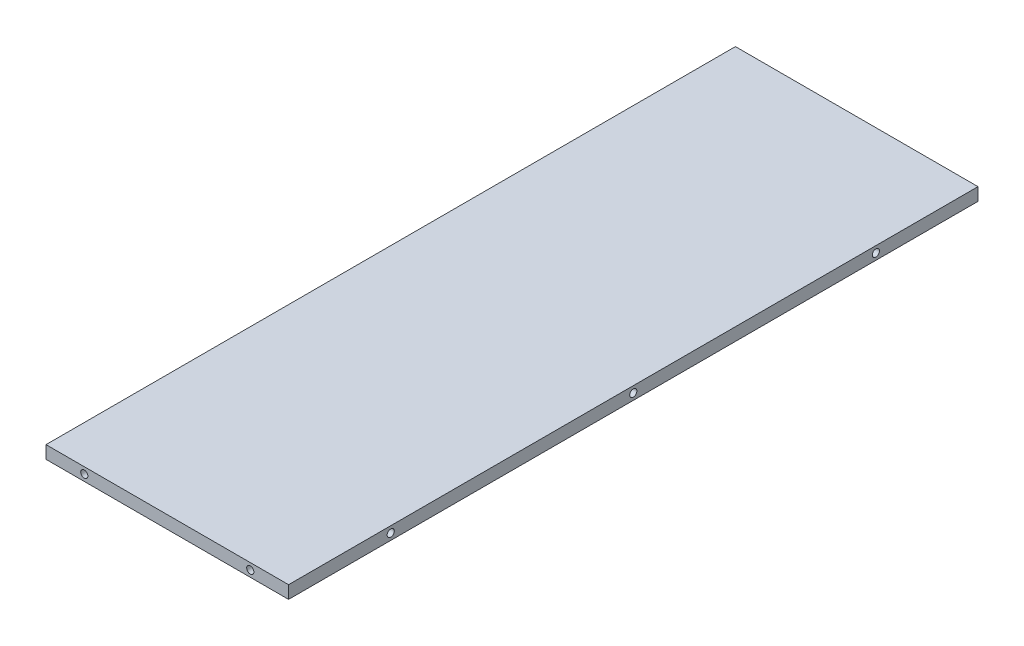
ISO-10303-21;
HEADER;
FILE_DESCRIPTION(('STEP AP214'),'2;1');
FILE_NAME('part.step','',(''),(''),'','','');
FILE_SCHEMA(('AUTOMOTIVE_DESIGN { 1 0 10303 214 1 1 1 1 }'));
ENDSEC;
DATA;
#1=APPLICATION_CONTEXT('core data for automotive mechanical design processes');
#2=APPLICATION_PROTOCOL_DEFINITION('international standard','automotive_design',2000,#1);
#3=PRODUCT_CONTEXT('',#1,'mechanical');
#4=PRODUCT('Part','Part','',(#3));
#5=PRODUCT_RELATED_PRODUCT_CATEGORY('part','',(#4));
#6=PRODUCT_DEFINITION_FORMATION('','',#4);
#7=PRODUCT_DEFINITION_CONTEXT('part definition',#1,'design');
#8=PRODUCT_DEFINITION('design','',#6,#7);
#9=PRODUCT_DEFINITION_SHAPE('','',#8);
#10=(LENGTH_UNIT() NAMED_UNIT(*) SI_UNIT(.MILLI.,.METRE.));
#11=(NAMED_UNIT(*) PLANE_ANGLE_UNIT() SI_UNIT($,.RADIAN.));
#12=(NAMED_UNIT(*) SI_UNIT($,.STERADIAN.) SOLID_ANGLE_UNIT());
#13=UNCERTAINTY_MEASURE_WITH_UNIT(LENGTH_MEASURE(1.E-05),#10,'distance_accuracy_value','');
#14=(GEOMETRIC_REPRESENTATION_CONTEXT(3) GLOBAL_UNCERTAINTY_ASSIGNED_CONTEXT((#13)) GLOBAL_UNIT_ASSIGNED_CONTEXT((#10,
#11,#12)) REPRESENTATION_CONTEXT('',''));
#15=CARTESIAN_POINT('',(0.,0.,0.));
#16=DIRECTION('',(0.,0.,1.));
#17=DIRECTION('',(1.,0.,0.));
#18=AXIS2_PLACEMENT_3D('',#15,#16,#17);
#19=CARTESIAN_POINT('',(-30.1625,3.175,-85.725));
#20=DIRECTION('',(1.,0.,0.));
#21=DIRECTION('',(0.,0.,-1.));
#22=AXIS2_PLACEMENT_3D('',#19,#20,#21);
#23=PLANE('',#22);
#24=CARTESIAN_POINT('',(-30.1625,1.5875,-60.325));
#25=DIRECTION('',(-1.,0.,0.));
#26=DIRECTION('',(0.,0.,1.));
#27=AXIS2_PLACEMENT_3D('',#24,#25,#26);
#28=CIRCLE('',#27,0.888999999999989);
#29=CARTESIAN_POINT('',(-30.1625,1.5875,-59.436));
#30=VERTEX_POINT('',#29);
#31=EDGE_CURVE('E111',#30,#30,#28,.T.);
#32=ORIENTED_EDGE('',*,*,#31,.F.);
#33=EDGE_LOOP('',(#32));
#34=FACE_BOUND('',#33,.T.);
#35=CARTESIAN_POINT('',(-30.1625,1.5875,60.325));
#36=DIRECTION('',(-1.,0.,0.));
#37=DIRECTION('',(0.,0.,1.));
#38=AXIS2_PLACEMENT_3D('',#35,#36,#37);
#39=CIRCLE('',#38,0.888999999999989);
#40=CARTESIAN_POINT('',(-30.1625,1.5875,61.214));
#41=VERTEX_POINT('',#40);
#42=EDGE_CURVE('E110',#41,#41,#39,.T.);
#43=ORIENTED_EDGE('',*,*,#42,.F.);
#44=EDGE_LOOP('',(#43));
#45=FACE_BOUND('',#44,.T.);
#46=CARTESIAN_POINT('',(-30.1625,1.5875,0.));
#47=DIRECTION('',(-1.,0.,0.));
#48=DIRECTION('',(0.,0.,1.));
#49=AXIS2_PLACEMENT_3D('',#46,#47,#48);
#50=CIRCLE('',#49,0.888999999999989);
#51=CARTESIAN_POINT('',(-30.1625,1.5875,0.889000000000003));
#52=VERTEX_POINT('',#51);
#53=EDGE_CURVE('E139',#52,#52,#50,.T.);
#54=ORIENTED_EDGE('',*,*,#53,.F.);
#55=EDGE_LOOP('',(#54));
#56=FACE_BOUND('',#55,.T.);
#57=DIRECTION('',(0.,0.,1.));
#58=VECTOR('',#57,1.);
#59=CARTESIAN_POINT('',(-30.1625,0.,-85.725));
#60=LINE('',#59,#58);
#61=CARTESIAN_POINT('',(-30.1625,0.,-85.725));
#62=VERTEX_POINT('',#61);
#63=CARTESIAN_POINT('',(-30.1625,0.,85.725));
#64=VERTEX_POINT('',#63);
#65=EDGE_CURVE('E169',#62,#64,#60,.T.);
#66=ORIENTED_EDGE('',*,*,#65,.T.);
#67=DIRECTION('',(0.,-1.,0.));
#68=VECTOR('',#67,1.);
#69=CARTESIAN_POINT('',(-30.1625,3.175,85.725));
#70=LINE('',#69,#68);
#71=CARTESIAN_POINT('',(-30.1625,3.175,85.725));
#72=VERTEX_POINT('',#71);
#73=EDGE_CURVE('E11',#72,#64,#70,.T.);
#74=ORIENTED_EDGE('',*,*,#73,.F.);
#75=DIRECTION('',(0.,0.,1.));
#76=VECTOR('',#75,1.);
#77=CARTESIAN_POINT('',(-30.1625,3.175,-85.725));
#78=LINE('',#77,#76);
#79=CARTESIAN_POINT('',(-30.1625,3.175,-85.725));
#80=VERTEX_POINT('',#79);
#81=EDGE_CURVE('E178',#80,#72,#78,.T.);
#82=ORIENTED_EDGE('',*,*,#81,.F.);
#83=DIRECTION('',(0.,-1.,0.));
#84=VECTOR('',#83,1.);
#85=CARTESIAN_POINT('',(-30.1625,3.175,-85.725));
#86=LINE('',#85,#84);
#87=EDGE_CURVE('E184',#80,#62,#86,.T.);
#88=ORIENTED_EDGE('',*,*,#87,.T.);
#89=EDGE_LOOP('',(#66,#74,#82,#88));
#90=FACE_BOUND('',#89,.T.);
#91=ADVANCED_FACE('F32',(#34,#45,#56,#90),#23,.F.);
#92=CARTESIAN_POINT('',(-30.1625,3.175,85.725));
#93=DIRECTION('',(0.,0.,-1.));
#94=DIRECTION('',(-1.,0.,0.));
#95=AXIS2_PLACEMENT_3D('',#92,#93,#94);
#96=PLANE('',#95);
#97=CARTESIAN_POINT('',(-20.6375,1.5875,85.725));
#98=DIRECTION('',(0.,0.,1.));
#99=DIRECTION('',(1.,0.,0.));
#100=AXIS2_PLACEMENT_3D('',#97,#98,#99);
#101=CIRCLE('',#100,0.888999999999987);
#102=CARTESIAN_POINT('',(-19.7485,1.5875,85.725));
#103=VERTEX_POINT('',#102);
#104=EDGE_CURVE('E160',#103,#103,#101,.T.);
#105=ORIENTED_EDGE('',*,*,#104,.F.);
#106=EDGE_LOOP('',(#105));
#107=FACE_BOUND('',#106,.T.);
#108=CARTESIAN_POINT('',(20.6375,1.5875,85.725));
#109=DIRECTION('',(0.,0.,1.));
#110=DIRECTION('',(1.,0.,0.));
#111=AXIS2_PLACEMENT_3D('',#108,#109,#110);
#112=CIRCLE('',#111,0.888999999999987);
#113=CARTESIAN_POINT('',(21.5265,1.5875,85.725));
#114=VERTEX_POINT('',#113);
#115=EDGE_CURVE('E166',#114,#114,#112,.T.);
#116=ORIENTED_EDGE('',*,*,#115,.F.);
#117=EDGE_LOOP('',(#116));
#118=FACE_BOUND('',#117,.T.);
#119=DIRECTION('',(1.,0.,0.));
#120=VECTOR('',#119,1.);
#121=CARTESIAN_POINT('',(-30.1625,0.,85.725));
#122=LINE('',#121,#120);
#123=CARTESIAN_POINT('',(30.1625,0.,85.725));
#124=VERTEX_POINT('',#123);
#125=EDGE_CURVE('E172',#64,#124,#122,.T.);
#126=ORIENTED_EDGE('',*,*,#125,.T.);
#127=DIRECTION('',(0.,-1.,0.));
#128=VECTOR('',#127,1.);
#129=CARTESIAN_POINT('',(30.1625,3.175,85.725));
#130=LINE('',#129,#128);
#131=CARTESIAN_POINT('',(30.1625,3.175,85.725));
#132=VERTEX_POINT('',#131);
#133=EDGE_CURVE('E39',#132,#124,#130,.T.);
#134=ORIENTED_EDGE('',*,*,#133,.F.);
#135=DIRECTION('',(1.,0.,0.));
#136=VECTOR('',#135,1.);
#137=CARTESIAN_POINT('',(-30.1625,3.175,85.725));
#138=LINE('',#137,#136);
#139=EDGE_CURVE('E180',#72,#132,#138,.T.);
#140=ORIENTED_EDGE('',*,*,#139,.F.);
#141=ORIENTED_EDGE('',*,*,#73,.T.);
#142=EDGE_LOOP('',(#126,#134,#140,#141));
#143=FACE_BOUND('',#142,.T.);
#144=ADVANCED_FACE('F205',(#107,#118,#143),#96,.F.);
#145=CARTESIAN_POINT('',(30.1625,3.175,-85.725));
#146=DIRECTION('',(-1.,0.,0.));
#147=DIRECTION('',(0.,0.,1.));
#148=AXIS2_PLACEMENT_3D('',#145,#146,#147);
#149=PLANE('',#148);
#150=CARTESIAN_POINT('',(30.1625,1.5875,-60.325));
#151=DIRECTION('',(1.,0.,0.));
#152=DIRECTION('',(0.,0.,-1.));
#153=AXIS2_PLACEMENT_3D('',#150,#151,#152);
#154=CIRCLE('',#153,0.888999999999989);
#155=CARTESIAN_POINT('',(30.1625,1.5875,-61.214));
#156=VERTEX_POINT('',#155);
#157=EDGE_CURVE('E121',#156,#156,#154,.T.);
#158=ORIENTED_EDGE('',*,*,#157,.F.);
#159=EDGE_LOOP('',(#158));
#160=FACE_BOUND('',#159,.T.);
#161=CARTESIAN_POINT('',(30.1625,1.5875,60.325));
#162=DIRECTION('',(1.,0.,0.));
#163=DIRECTION('',(0.,0.,-1.));
#164=AXIS2_PLACEMENT_3D('',#161,#162,#163);
#165=CIRCLE('',#164,0.888999999999989);
#166=CARTESIAN_POINT('',(30.1625,1.5875,59.436));
#167=VERTEX_POINT('',#166);
#168=EDGE_CURVE('E127',#167,#167,#165,.T.);
#169=ORIENTED_EDGE('',*,*,#168,.F.);
#170=EDGE_LOOP('',(#169));
#171=FACE_BOUND('',#170,.T.);
#172=CARTESIAN_POINT('',(30.1625,1.5875,0.));
#173=DIRECTION('',(1.,0.,0.));
#174=DIRECTION('',(0.,0.,-1.));
#175=AXIS2_PLACEMENT_3D('',#172,#173,#174);
#176=CIRCLE('',#175,0.888999999999989);
#177=CARTESIAN_POINT('',(30.1625,1.5875,-0.888999999999975));
#178=VERTEX_POINT('',#177);
#179=EDGE_CURVE('E133',#178,#178,#176,.T.);
#180=ORIENTED_EDGE('',*,*,#179,.F.);
#181=EDGE_LOOP('',(#180));
#182=FACE_BOUND('',#181,.T.);
#183=DIRECTION('',(0.,0.,-1.));
#184=VECTOR('',#183,1.);
#185=CARTESIAN_POINT('',(30.1625,0.,-85.725));
#186=LINE('',#185,#184);
#187=CARTESIAN_POINT('',(30.1625,0.,-85.725));
#188=VERTEX_POINT('',#187);
#189=EDGE_CURVE('E174',#124,#188,#186,.T.);
#190=ORIENTED_EDGE('',*,*,#189,.T.);
#191=DIRECTION('',(0.,-1.,0.));
#192=VECTOR('',#191,1.);
#193=CARTESIAN_POINT('',(30.1625,3.175,-85.725));
#194=LINE('',#193,#192);
#195=CARTESIAN_POINT('',(30.1625,3.175,-85.725));
#196=VERTEX_POINT('',#195);
#197=EDGE_CURVE('E187',#196,#188,#194,.T.);
#198=ORIENTED_EDGE('',*,*,#197,.F.);
#199=DIRECTION('',(0.,0.,-1.));
#200=VECTOR('',#199,1.);
#201=CARTESIAN_POINT('',(30.1625,3.175,-85.725));
#202=LINE('',#201,#200);
#203=EDGE_CURVE('E51',#132,#196,#202,.T.);
#204=ORIENTED_EDGE('',*,*,#203,.F.);
#205=ORIENTED_EDGE('',*,*,#133,.T.);
#206=EDGE_LOOP('',(#190,#198,#204,#205));
#207=FACE_BOUND('',#206,.T.);
#208=ADVANCED_FACE('F193',(#160,#171,#182,#207),#149,.F.);
#209=CARTESIAN_POINT('',(-30.1625,3.175,-85.725));
#210=DIRECTION('',(0.,0.,1.));
#211=DIRECTION('',(1.,0.,0.));
#212=AXIS2_PLACEMENT_3D('',#209,#210,#211);
#213=PLANE('',#212);
#214=CARTESIAN_POINT('',(20.6375,1.5875,-85.725));
#215=DIRECTION('',(0.,0.,-1.));
#216=DIRECTION('',(-1.,0.,0.));
#217=AXIS2_PLACEMENT_3D('',#214,#215,#216);
#218=CIRCLE('',#217,0.888999999999987);
#219=CARTESIAN_POINT('',(19.7485,1.5875,-85.725));
#220=VERTEX_POINT('',#219);
#221=EDGE_CURVE('E145',#220,#220,#218,.T.);
#222=ORIENTED_EDGE('',*,*,#221,.F.);
#223=EDGE_LOOP('',(#222));
#224=FACE_BOUND('',#223,.T.);
#225=CARTESIAN_POINT('',(-20.6375,1.5875,-85.725));
#226=DIRECTION('',(0.,0.,-1.));
#227=DIRECTION('',(-1.,0.,0.));
#228=AXIS2_PLACEMENT_3D('',#225,#226,#227);
#229=CIRCLE('',#228,0.888999999999987);
#230=CARTESIAN_POINT('',(-21.5265,1.5875,-85.725));
#231=VERTEX_POINT('',#230);
#232=EDGE_CURVE('E151',#231,#231,#229,.T.);
#233=ORIENTED_EDGE('',*,*,#232,.F.);
#234=EDGE_LOOP('',(#233));
#235=FACE_BOUND('',#234,.T.);
#236=DIRECTION('',(-1.,0.,0.));
#237=VECTOR('',#236,1.);
#238=CARTESIAN_POINT('',(-30.1625,0.,-85.725));
#239=LINE('',#238,#237);
#240=EDGE_CURVE('E176',#188,#62,#239,.T.);
#241=ORIENTED_EDGE('',*,*,#240,.T.);
#242=ORIENTED_EDGE('',*,*,#87,.F.);
#243=DIRECTION('',(-1.,0.,0.));
#244=VECTOR('',#243,1.);
#245=CARTESIAN_POINT('',(-30.1625,3.175,-85.725));
#246=LINE('',#245,#244);
#247=EDGE_CURVE('E46',#196,#80,#246,.T.);
#248=ORIENTED_EDGE('',*,*,#247,.F.);
#249=ORIENTED_EDGE('',*,*,#197,.T.);
#250=EDGE_LOOP('',(#241,#242,#248,#249));
#251=FACE_BOUND('',#250,.T.);
#252=ADVANCED_FACE('F200',(#224,#235,#251),#213,.F.);
#253=CARTESIAN_POINT('',(-30.1625,3.175,-85.725));
#254=DIRECTION('',(0.,1.,0.));
#255=DIRECTION('',(0.,0.,1.));
#256=AXIS2_PLACEMENT_3D('',#253,#254,#255);
#257=PLANE('',#256);
#258=ORIENTED_EDGE('',*,*,#81,.T.);
#259=ORIENTED_EDGE('',*,*,#139,.T.);
#260=ORIENTED_EDGE('',*,*,#203,.T.);
#261=ORIENTED_EDGE('',*,*,#247,.T.);
#262=EDGE_LOOP('',(#258,#259,#260,#261));
#263=FACE_BOUND('',#262,.T.);
#264=ADVANCED_FACE('F204',(#263),#257,.T.);
#265=CARTESIAN_POINT('',(-30.1625,0.,-85.725));
#266=DIRECTION('',(0.,1.,0.));
#267=DIRECTION('',(0.,0.,1.));
#268=AXIS2_PLACEMENT_3D('',#265,#266,#267);
#269=PLANE('',#268);
#270=ORIENTED_EDGE('',*,*,#65,.F.);
#271=ORIENTED_EDGE('',*,*,#240,.F.);
#272=ORIENTED_EDGE('',*,*,#189,.F.);
#273=ORIENTED_EDGE('',*,*,#125,.F.);
#274=EDGE_LOOP('',(#270,#271,#272,#273));
#275=FACE_BOUND('',#274,.T.);
#276=ADVANCED_FACE('F198',(#275),#269,.F.);
#277=CARTESIAN_POINT('',(20.6375,1.5875,85.725));
#278=DIRECTION('',(0.,0.,1.));
#279=DIRECTION('',(1.,0.,0.));
#280=AXIS2_PLACEMENT_3D('',#277,#278,#279);
#281=CYLINDRICAL_SURFACE('',#280,0.888999999999992);
#282=CARTESIAN_POINT('',(20.6375,1.5875,79.375));
#283=DIRECTION('',(0.,0.,1.));
#284=DIRECTION('',(1.,0.,0.));
#285=AXIS2_PLACEMENT_3D('',#282,#283,#284);
#286=CIRCLE('',#285,0.888999999999997);
#287=CARTESIAN_POINT('',(21.5265,1.5875,79.375));
#288=VERTEX_POINT('',#287);
#289=EDGE_CURVE('E163',#288,#288,#286,.T.);
#290=ORIENTED_EDGE('',*,*,#289,.F.);
#291=EDGE_LOOP('',(#290));
#292=FACE_BOUND('',#291,.T.);
#293=ORIENTED_EDGE('',*,*,#115,.T.);
#294=EDGE_LOOP('',(#293));
#295=FACE_BOUND('',#294,.T.);
#296=ADVANCED_FACE('F225',(#292,#295),#281,.F.);
#297=CARTESIAN_POINT('',(20.6375,1.5875,79.375));
#298=DIRECTION('',(0.,0.,1.));
#299=DIRECTION('',(1.,0.,0.));
#300=AXIS2_PLACEMENT_3D('',#297,#298,#299);
#301=CONICAL_SURFACE('',#300,0.888999999999997,1.02974425867666);
#302=CARTESIAN_POINT('',(20.6375,1.5875,78.8408349096845));
#303=VERTEX_POINT('',#302);
#304=VERTEX_LOOP('',#303);
#305=FACE_BOUND('',#304,.T.);
#306=ORIENTED_EDGE('',*,*,#289,.T.);
#307=EDGE_LOOP('',(#306));
#308=FACE_BOUND('',#307,.T.);
#309=ADVANCED_FACE('F228',(#305,#308),#301,.F.);
#310=CARTESIAN_POINT('',(-20.6375,1.5875,85.725));
#311=DIRECTION('',(0.,0.,1.));
#312=DIRECTION('',(1.,0.,0.));
#313=AXIS2_PLACEMENT_3D('',#310,#311,#312);
#314=CYLINDRICAL_SURFACE('',#313,0.888999999999992);
#315=CARTESIAN_POINT('',(-20.6375,1.5875,79.375));
#316=DIRECTION('',(0.,0.,1.));
#317=DIRECTION('',(1.,0.,0.));
#318=AXIS2_PLACEMENT_3D('',#315,#316,#317);
#319=CIRCLE('',#318,0.888999999999997);
#320=CARTESIAN_POINT('',(-19.7485,1.5875,79.375));
#321=VERTEX_POINT('',#320);
#322=EDGE_CURVE('E157',#321,#321,#319,.T.);
#323=ORIENTED_EDGE('',*,*,#322,.F.);
#324=EDGE_LOOP('',(#323));
#325=FACE_BOUND('',#324,.T.);
#326=ORIENTED_EDGE('',*,*,#104,.T.);
#327=EDGE_LOOP('',(#326));
#328=FACE_BOUND('',#327,.T.);
#329=ADVANCED_FACE('F232',(#325,#328),#314,.F.);
#330=CARTESIAN_POINT('',(-20.6375,1.5875,79.375));
#331=DIRECTION('',(0.,0.,1.));
#332=DIRECTION('',(1.,0.,0.));
#333=AXIS2_PLACEMENT_3D('',#330,#331,#332);
#334=CONICAL_SURFACE('',#333,0.888999999999997,1.02974425867665);
#335=CARTESIAN_POINT('',(-20.6375,1.5875,78.8408349096845));
#336=VERTEX_POINT('',#335);
#337=VERTEX_LOOP('',#336);
#338=FACE_BOUND('',#337,.T.);
#339=ORIENTED_EDGE('',*,*,#322,.T.);
#340=EDGE_LOOP('',(#339));
#341=FACE_BOUND('',#340,.T.);
#342=ADVANCED_FACE('F236',(#338,#341),#334,.F.);
#343=CARTESIAN_POINT('',(-20.6375,1.5875,-79.375));
#344=DIRECTION('',(0.,0.,-1.));
#345=DIRECTION('',(-1.,0.,0.));
#346=AXIS2_PLACEMENT_3D('',#343,#344,#345);
#347=CONICAL_SURFACE('',#346,0.888999999999987,1.02974425867665);
#348=CARTESIAN_POINT('',(-20.6375,1.5875,-78.8408349096845));
#349=VERTEX_POINT('',#348);
#350=VERTEX_LOOP('',#349);
#351=FACE_BOUND('',#350,.T.);
#352=CARTESIAN_POINT('',(-20.6375,1.5875,-79.375));
#353=DIRECTION('',(0.,0.,-1.));
#354=DIRECTION('',(-1.,0.,0.));
#355=AXIS2_PLACEMENT_3D('',#352,#353,#354);
#356=CIRCLE('',#355,0.888999999999987);
#357=CARTESIAN_POINT('',(-21.5265,1.5875,-79.375));
#358=VERTEX_POINT('',#357);
#359=EDGE_CURVE('E154',#358,#358,#356,.T.);
#360=ORIENTED_EDGE('',*,*,#359,.T.);
#361=EDGE_LOOP('',(#360));
#362=FACE_BOUND('',#361,.T.);
#363=ADVANCED_FACE('F240',(#351,#362),#347,.F.);
#364=CARTESIAN_POINT('',(-20.6375,1.5875,-85.725));
#365=DIRECTION('',(0.,0.,-1.));
#366=DIRECTION('',(-1.,0.,0.));
#367=AXIS2_PLACEMENT_3D('',#364,#365,#366);
#368=CYLINDRICAL_SURFACE('',#367,0.888999999999987);
#369=ORIENTED_EDGE('',*,*,#359,.F.);
#370=EDGE_LOOP('',(#369));
#371=FACE_BOUND('',#370,.T.);
#372=ORIENTED_EDGE('',*,*,#232,.T.);
#373=EDGE_LOOP('',(#372));
#374=FACE_BOUND('',#373,.T.);
#375=ADVANCED_FACE('F244',(#371,#374),#368,.F.);
#376=CARTESIAN_POINT('',(20.6375,1.5875,-79.375));
#377=DIRECTION('',(0.,0.,-1.));
#378=DIRECTION('',(-1.,0.,0.));
#379=AXIS2_PLACEMENT_3D('',#376,#377,#378);
#380=CONICAL_SURFACE('',#379,0.888999999999987,1.02974425867665);
#381=CARTESIAN_POINT('',(20.6375,1.5875,-78.8408349096845));
#382=VERTEX_POINT('',#381);
#383=VERTEX_LOOP('',#382);
#384=FACE_BOUND('',#383,.T.);
#385=CARTESIAN_POINT('',(20.6375,1.5875,-79.375));
#386=DIRECTION('',(0.,0.,-1.));
#387=DIRECTION('',(-1.,0.,0.));
#388=AXIS2_PLACEMENT_3D('',#385,#386,#387);
#389=CIRCLE('',#388,0.888999999999987);
#390=CARTESIAN_POINT('',(19.7485,1.5875,-79.375));
#391=VERTEX_POINT('',#390);
#392=EDGE_CURVE('E148',#391,#391,#389,.T.);
#393=ORIENTED_EDGE('',*,*,#392,.T.);
#394=EDGE_LOOP('',(#393));
#395=FACE_BOUND('',#394,.T.);
#396=ADVANCED_FACE('F248',(#384,#395),#380,.F.);
#397=CARTESIAN_POINT('',(20.6375,1.5875,-85.725));
#398=DIRECTION('',(0.,0.,-1.));
#399=DIRECTION('',(-1.,0.,0.));
#400=AXIS2_PLACEMENT_3D('',#397,#398,#399);
#401=CYLINDRICAL_SURFACE('',#400,0.888999999999987);
#402=ORIENTED_EDGE('',*,*,#392,.F.);
#403=EDGE_LOOP('',(#402));
#404=FACE_BOUND('',#403,.T.);
#405=ORIENTED_EDGE('',*,*,#221,.T.);
#406=EDGE_LOOP('',(#405));
#407=FACE_BOUND('',#406,.T.);
#408=ADVANCED_FACE('F252',(#404,#407),#401,.F.);
#409=CARTESIAN_POINT('',(-23.8125,1.5875,0.));
#410=DIRECTION('',(-1.,0.,0.));
#411=DIRECTION('',(0.,0.,1.));
#412=AXIS2_PLACEMENT_3D('',#409,#410,#411);
#413=CONICAL_SURFACE('',#412,0.888999999999987,1.02974425867665);
#414=CARTESIAN_POINT('',(-23.2783349096845,1.5875,0.));
#415=VERTEX_POINT('',#414);
#416=VERTEX_LOOP('',#415);
#417=FACE_BOUND('',#416,.T.);
#418=CARTESIAN_POINT('',(-23.8125,1.5875,0.));
#419=DIRECTION('',(-1.,0.,0.));
#420=DIRECTION('',(0.,0.,1.));
#421=AXIS2_PLACEMENT_3D('',#418,#419,#420);
#422=CIRCLE('',#421,0.888999999999987);
#423=CARTESIAN_POINT('',(-23.8125,1.5875,0.889));
#424=VERTEX_POINT('',#423);
#425=EDGE_CURVE('E142',#424,#424,#422,.T.);
#426=ORIENTED_EDGE('',*,*,#425,.T.);
#427=EDGE_LOOP('',(#426));
#428=FACE_BOUND('',#427,.T.);
#429=ADVANCED_FACE('F256',(#417,#428),#413,.F.);
#430=CARTESIAN_POINT('',(-30.1625,1.5875,0.));
#431=DIRECTION('',(-1.,0.,0.));
#432=DIRECTION('',(0.,0.,1.));
#433=AXIS2_PLACEMENT_3D('',#430,#431,#432);
#434=CYLINDRICAL_SURFACE('',#433,0.888999999999988);
#435=ORIENTED_EDGE('',*,*,#425,.F.);
#436=EDGE_LOOP('',(#435));
#437=FACE_BOUND('',#436,.T.);
#438=ORIENTED_EDGE('',*,*,#53,.T.);
#439=EDGE_LOOP('',(#438));
#440=FACE_BOUND('',#439,.T.);
#441=ADVANCED_FACE('F260',(#437,#440),#434,.F.);
#442=CARTESIAN_POINT('',(23.8125,1.5875,0.));
#443=DIRECTION('',(1.,0.,0.));
#444=DIRECTION('',(0.,0.,-1.));
#445=AXIS2_PLACEMENT_3D('',#442,#443,#444);
#446=CONICAL_SURFACE('',#445,0.888999999999987,1.02974425867665);
#447=CARTESIAN_POINT('',(23.2783349096845,1.5875,0.));
#448=VERTEX_POINT('',#447);
#449=VERTEX_LOOP('',#448);
#450=FACE_BOUND('',#449,.T.);
#451=CARTESIAN_POINT('',(23.8125,1.5875,0.));
#452=DIRECTION('',(1.,0.,0.));
#453=DIRECTION('',(0.,0.,-1.));
#454=AXIS2_PLACEMENT_3D('',#451,#452,#453);
#455=CIRCLE('',#454,0.888999999999987);
#456=CARTESIAN_POINT('',(23.8125,1.5875,-0.888999999999972));
#457=VERTEX_POINT('',#456);
#458=EDGE_CURVE('E136',#457,#457,#455,.T.);
#459=ORIENTED_EDGE('',*,*,#458,.T.);
#460=EDGE_LOOP('',(#459));
#461=FACE_BOUND('',#460,.T.);
#462=ADVANCED_FACE('F264',(#450,#461),#446,.F.);
#463=CARTESIAN_POINT('',(30.1625,1.5875,0.));
#464=DIRECTION('',(1.,0.,0.));
#465=DIRECTION('',(0.,0.,-1.));
#466=AXIS2_PLACEMENT_3D('',#463,#464,#465);
#467=CYLINDRICAL_SURFACE('',#466,0.888999999999988);
#468=ORIENTED_EDGE('',*,*,#458,.F.);
#469=EDGE_LOOP('',(#468));
#470=FACE_BOUND('',#469,.T.);
#471=ORIENTED_EDGE('',*,*,#179,.T.);
#472=EDGE_LOOP('',(#471));
#473=FACE_BOUND('',#472,.T.);
#474=ADVANCED_FACE('F268',(#470,#473),#467,.F.);
#475=CARTESIAN_POINT('',(23.8125,1.5875,60.325));
#476=DIRECTION('',(1.,0.,0.));
#477=DIRECTION('',(0.,0.,-1.));
#478=AXIS2_PLACEMENT_3D('',#475,#476,#477);
#479=CONICAL_SURFACE('',#478,0.888999999999987,1.02974425867665);
#480=CARTESIAN_POINT('',(23.2783349096845,1.5875,60.325));
#481=VERTEX_POINT('',#480);
#482=VERTEX_LOOP('',#481);
#483=FACE_BOUND('',#482,.T.);
#484=CARTESIAN_POINT('',(23.8125,1.5875,60.325));
#485=DIRECTION('',(1.,0.,0.));
#486=DIRECTION('',(0.,0.,-1.));
#487=AXIS2_PLACEMENT_3D('',#484,#485,#486);
#488=CIRCLE('',#487,0.888999999999987);
#489=CARTESIAN_POINT('',(23.8125,1.5875,59.436));
#490=VERTEX_POINT('',#489);
#491=EDGE_CURVE('E130',#490,#490,#488,.T.);
#492=ORIENTED_EDGE('',*,*,#491,.T.);
#493=EDGE_LOOP('',(#492));
#494=FACE_BOUND('',#493,.T.);
#495=ADVANCED_FACE('F272',(#483,#494),#479,.F.);
#496=CARTESIAN_POINT('',(30.1625,1.5875,60.325));
#497=DIRECTION('',(1.,0.,0.));
#498=DIRECTION('',(0.,0.,-1.));
#499=AXIS2_PLACEMENT_3D('',#496,#497,#498);
#500=CYLINDRICAL_SURFACE('',#499,0.888999999999988);
#501=ORIENTED_EDGE('',*,*,#491,.F.);
#502=EDGE_LOOP('',(#501));
#503=FACE_BOUND('',#502,.T.);
#504=ORIENTED_EDGE('',*,*,#168,.T.);
#505=EDGE_LOOP('',(#504));
#506=FACE_BOUND('',#505,.T.);
#507=ADVANCED_FACE('F276',(#503,#506),#500,.F.);
#508=CARTESIAN_POINT('',(23.8125,1.5875,-60.325));
#509=DIRECTION('',(1.,0.,0.));
#510=DIRECTION('',(0.,0.,-1.));
#511=AXIS2_PLACEMENT_3D('',#508,#509,#510);
#512=CONICAL_SURFACE('',#511,0.888999999999987,1.02974425867665);
#513=CARTESIAN_POINT('',(23.2783349096845,1.5875,-60.325));
#514=VERTEX_POINT('',#513);
#515=VERTEX_LOOP('',#514);
#516=FACE_BOUND('',#515,.T.);
#517=CARTESIAN_POINT('',(23.8125,1.5875,-60.325));
#518=DIRECTION('',(1.,0.,0.));
#519=DIRECTION('',(0.,0.,-1.));
#520=AXIS2_PLACEMENT_3D('',#517,#518,#519);
#521=CIRCLE('',#520,0.888999999999987);
#522=CARTESIAN_POINT('',(23.8125,1.5875,-61.214));
#523=VERTEX_POINT('',#522);
#524=EDGE_CURVE('E124',#523,#523,#521,.T.);
#525=ORIENTED_EDGE('',*,*,#524,.T.);
#526=EDGE_LOOP('',(#525));
#527=FACE_BOUND('',#526,.T.);
#528=ADVANCED_FACE('F280',(#516,#527),#512,.F.);
#529=CARTESIAN_POINT('',(30.1625,1.5875,-60.325));
#530=DIRECTION('',(1.,0.,0.));
#531=DIRECTION('',(0.,0.,-1.));
#532=AXIS2_PLACEMENT_3D('',#529,#530,#531);
#533=CYLINDRICAL_SURFACE('',#532,0.888999999999988);
#534=ORIENTED_EDGE('',*,*,#524,.F.);
#535=EDGE_LOOP('',(#534));
#536=FACE_BOUND('',#535,.T.);
#537=ORIENTED_EDGE('',*,*,#157,.T.);
#538=EDGE_LOOP('',(#537));
#539=FACE_BOUND('',#538,.T.);
#540=ADVANCED_FACE('F284',(#536,#539),#533,.F.);
#541=CARTESIAN_POINT('',(-23.8125,1.5875,60.325));
#542=DIRECTION('',(-1.,0.,0.));
#543=DIRECTION('',(0.,0.,1.));
#544=AXIS2_PLACEMENT_3D('',#541,#542,#543);
#545=CONICAL_SURFACE('',#544,0.888999999999987,1.02974425867665);
#546=CARTESIAN_POINT('',(-23.2783349096845,1.5875,60.325));
#547=VERTEX_POINT('',#546);
#548=VERTEX_LOOP('',#547);
#549=FACE_BOUND('',#548,.T.);
#550=CARTESIAN_POINT('',(-23.8125,1.5875,60.325));
#551=DIRECTION('',(-1.,0.,0.));
#552=DIRECTION('',(0.,0.,1.));
#553=AXIS2_PLACEMENT_3D('',#550,#551,#552);
#554=CIRCLE('',#553,0.888999999999987);
#555=CARTESIAN_POINT('',(-23.8125,1.5875,61.214));
#556=VERTEX_POINT('',#555);
#557=EDGE_CURVE('E114',#556,#556,#554,.T.);
#558=ORIENTED_EDGE('',*,*,#557,.T.);
#559=EDGE_LOOP('',(#558));
#560=FACE_BOUND('',#559,.T.);
#561=ADVANCED_FACE('F288',(#549,#560),#545,.F.);
#562=CARTESIAN_POINT('',(-30.1625,1.5875,60.325));
#563=DIRECTION('',(-1.,0.,0.));
#564=DIRECTION('',(0.,0.,1.));
#565=AXIS2_PLACEMENT_3D('',#562,#563,#564);
#566=CYLINDRICAL_SURFACE('',#565,0.888999999999988);
#567=ORIENTED_EDGE('',*,*,#557,.F.);
#568=EDGE_LOOP('',(#567));
#569=FACE_BOUND('',#568,.T.);
#570=ORIENTED_EDGE('',*,*,#42,.T.);
#571=EDGE_LOOP('',(#570));
#572=FACE_BOUND('',#571,.T.);
#573=ADVANCED_FACE('F104',(#569,#572),#566,.F.);
#574=CARTESIAN_POINT('',(-23.8125,1.5875,-60.325));
#575=DIRECTION('',(-1.,0.,0.));
#576=DIRECTION('',(0.,0.,1.));
#577=AXIS2_PLACEMENT_3D('',#574,#575,#576);
#578=CONICAL_SURFACE('',#577,0.888999999999987,1.02974425867665);
#579=CARTESIAN_POINT('',(-23.2783349096845,1.5875,-60.325));
#580=VERTEX_POINT('',#579);
#581=VERTEX_LOOP('',#580);
#582=FACE_BOUND('',#581,.T.);
#583=CARTESIAN_POINT('',(-23.8125,1.5875,-60.325));
#584=DIRECTION('',(-1.,0.,0.));
#585=DIRECTION('',(0.,0.,1.));
#586=AXIS2_PLACEMENT_3D('',#583,#584,#585);
#587=CIRCLE('',#586,0.888999999999987);
#588=CARTESIAN_POINT('',(-23.8125,1.5875,-59.436));
#589=VERTEX_POINT('',#588);
#590=EDGE_CURVE('E108',#589,#589,#587,.T.);
#591=ORIENTED_EDGE('',*,*,#590,.T.);
#592=EDGE_LOOP('',(#591));
#593=FACE_BOUND('',#592,.T.);
#594=ADVANCED_FACE('F100',(#582,#593),#578,.F.);
#595=CARTESIAN_POINT('',(-30.1625,1.5875,-60.325));
#596=DIRECTION('',(-1.,0.,0.));
#597=DIRECTION('',(0.,0.,1.));
#598=AXIS2_PLACEMENT_3D('',#595,#596,#597);
#599=CYLINDRICAL_SURFACE('',#598,0.888999999999988);
#600=ORIENTED_EDGE('',*,*,#590,.F.);
#601=EDGE_LOOP('',(#600));
#602=FACE_BOUND('',#601,.T.);
#603=ORIENTED_EDGE('',*,*,#31,.T.);
#604=EDGE_LOOP('',(#603));
#605=FACE_BOUND('',#604,.T.);
#606=ADVANCED_FACE('F103',(#602,#605),#599,.F.);
#607=CLOSED_SHELL('',(#91,#144,#208,#252,#264,#276,#296,#309,#329,#342,#363,#375,#396,#408,#429,
#441,#462,#474,#495,#507,#528,#540,#561,#573,#594,#606));
#608=MANIFOLD_SOLID_BREP('B2',#607);
#609=ADVANCED_BREP_SHAPE_REPRESENTATION('',(#18,#608),#14);
#610=SHAPE_DEFINITION_REPRESENTATION(#9,#609);
ENDSEC;
END-ISO-10303-21;
